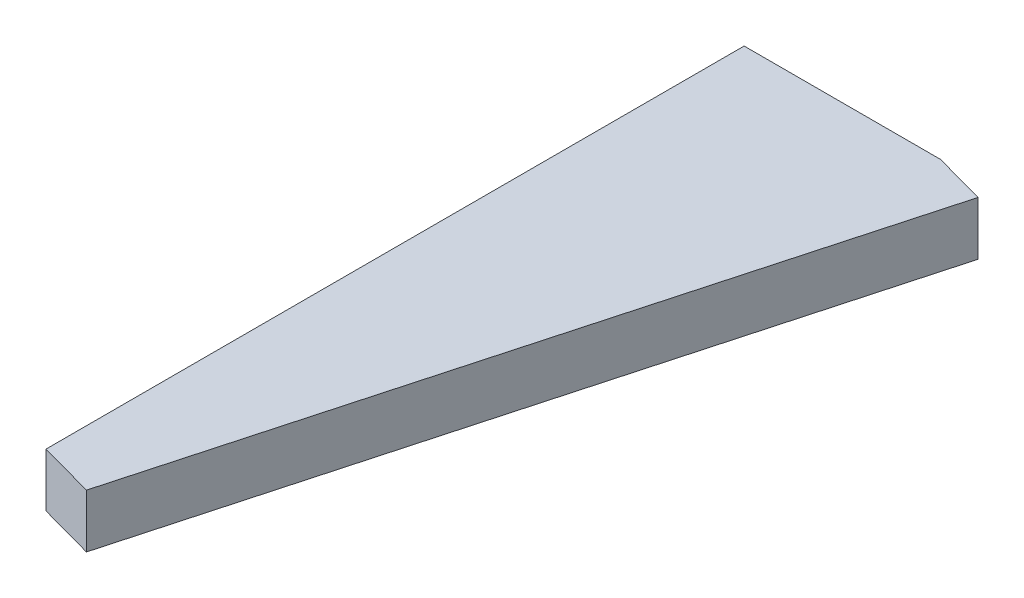
ISO-10303-21;
HEADER;
FILE_DESCRIPTION(('STEP AP214'),'2;1');
FILE_NAME('part.step','',(''),(''),'','','');
FILE_SCHEMA(('AUTOMOTIVE_DESIGN { 1 0 10303 214 1 1 1 1 }'));
ENDSEC;
DATA;
#1=APPLICATION_CONTEXT('core data for automotive mechanical design processes');
#2=APPLICATION_PROTOCOL_DEFINITION('international standard','automotive_design',2000,#1);
#3=PRODUCT_CONTEXT('',#1,'mechanical');
#4=PRODUCT('Part','Part','',(#3));
#5=PRODUCT_RELATED_PRODUCT_CATEGORY('part','',(#4));
#6=PRODUCT_DEFINITION_FORMATION('','',#4);
#7=PRODUCT_DEFINITION_CONTEXT('part definition',#1,'design');
#8=PRODUCT_DEFINITION('design','',#6,#7);
#9=PRODUCT_DEFINITION_SHAPE('','',#8);
#10=(LENGTH_UNIT() NAMED_UNIT(*) SI_UNIT(.MILLI.,.METRE.));
#11=(NAMED_UNIT(*) PLANE_ANGLE_UNIT() SI_UNIT($,.RADIAN.));
#12=(NAMED_UNIT(*) SI_UNIT($,.STERADIAN.) SOLID_ANGLE_UNIT());
#13=UNCERTAINTY_MEASURE_WITH_UNIT(LENGTH_MEASURE(1.E-05),#10,'distance_accuracy_value','');
#14=(GEOMETRIC_REPRESENTATION_CONTEXT(3) GLOBAL_UNCERTAINTY_ASSIGNED_CONTEXT((#13)) GLOBAL_UNIT_ASSIGNED_CONTEXT((#10,
#11,#12)) REPRESENTATION_CONTEXT('',''));
#15=CARTESIAN_POINT('',(0.,0.,0.));
#16=DIRECTION('',(0.,0.,1.));
#17=DIRECTION('',(1.,0.,0.));
#18=AXIS2_PLACEMENT_3D('',#15,#16,#17);
#19=CARTESIAN_POINT('',(13.8926161784114,3.,-39.2045305509369));
#20=DIRECTION('',(0.96420539280379,0.,0.265156483021042));
#21=DIRECTION('',(0.265156483021042,0.,-0.96420539280379));
#22=AXIS2_PLACEMENT_3D('',#19,#20,#21);
#23=PLANE('',#22);
#24=DIRECTION('',(-0.265156483021042,0.,0.96420539280379));
#25=VECTOR('',#24,1.);
#26=CARTESIAN_POINT('',(13.8926161784114,0.,-39.2045305509369));
#27=LINE('',#26,#25);
#28=CARTESIAN_POINT('',(13.8926161784114,0.,-39.2045305509369));
#29=VERTEX_POINT('',#28);
#30=CARTESIAN_POINT('',(3.12330231863968,0.,-0.0433892426761686));
#31=VERTEX_POINT('',#30);
#32=EDGE_CURVE('E111',#29,#31,#27,.T.);
#33=ORIENTED_EDGE('',*,*,#32,.F.);
#34=DIRECTION('',(0.,-1.,0.));
#35=VECTOR('',#34,1.);
#36=CARTESIAN_POINT('',(13.8926161784114,3.,-39.2045305509369));
#37=LINE('',#36,#35);
#38=CARTESIAN_POINT('',(13.8926161784114,3.,-39.2045305509369));
#39=VERTEX_POINT('',#38);
#40=EDGE_CURVE('E11',#39,#29,#37,.T.);
#41=ORIENTED_EDGE('',*,*,#40,.F.);
#42=DIRECTION('',(-0.265156483021042,0.,0.96420539280379));
#43=VECTOR('',#42,1.);
#44=CARTESIAN_POINT('',(13.8926161784114,3.,-39.2045305509369));
#45=LINE('',#44,#43);
#46=CARTESIAN_POINT('',(3.12330231863968,3.,-0.0433892426761686));
#47=VERTEX_POINT('',#46);
#48=EDGE_CURVE('E106',#39,#47,#45,.T.);
#49=ORIENTED_EDGE('',*,*,#48,.T.);
#50=DIRECTION('',(0.,-1.,0.));
#51=VECTOR('',#50,1.);
#52=CARTESIAN_POINT('',(3.12330231863968,3.,-0.0433892426761686));
#53=LINE('',#52,#51);
#54=EDGE_CURVE('E36',#47,#31,#53,.T.);
#55=ORIENTED_EDGE('',*,*,#54,.T.);
#56=EDGE_LOOP('',(#33,#41,#49,#55));
#57=FACE_BOUND('',#56,.T.);
#58=ADVANCED_FACE('F33',(#57),#23,.T.);
#59=CARTESIAN_POINT('',(13.8926161784114,3.,-39.2045305509369));
#60=DIRECTION('',(-0.265156483021042,0.,0.96420539280379));
#61=DIRECTION('',(0.96420539280379,0.,0.265156483021042));
#62=AXIS2_PLACEMENT_3D('',#59,#60,#61);
#63=PLANE('',#62);
#64=DIRECTION('',(-0.96420539280379,0.,-0.265156483021042));
#65=VECTOR('',#64,1.);
#66=CARTESIAN_POINT('',(13.8926161784114,0.,-39.2045305509369));
#67=LINE('',#66,#65);
#68=CARTESIAN_POINT('',(11.,0.,-40.));
#69=VERTEX_POINT('',#68);
#70=EDGE_CURVE('E120',#29,#69,#67,.T.);
#71=ORIENTED_EDGE('',*,*,#70,.T.);
#72=DIRECTION('',(0.,-1.,0.));
#73=VECTOR('',#72,1.);
#74=CARTESIAN_POINT('',(11.,3.,-40.));
#75=LINE('',#74,#73);
#76=CARTESIAN_POINT('',(11.,3.,-40.));
#77=VERTEX_POINT('',#76);
#78=EDGE_CURVE('E42',#77,#69,#75,.T.);
#79=ORIENTED_EDGE('',*,*,#78,.F.);
#80=DIRECTION('',(-0.96420539280379,0.,-0.265156483021042));
#81=VECTOR('',#80,1.);
#82=CARTESIAN_POINT('',(13.8926161784114,3.,-39.2045305509369));
#83=LINE('',#82,#81);
#84=EDGE_CURVE('E101',#39,#77,#83,.T.);
#85=ORIENTED_EDGE('',*,*,#84,.F.);
#86=ORIENTED_EDGE('',*,*,#40,.T.);
#87=EDGE_LOOP('',(#71,#79,#85,#86));
#88=FACE_BOUND('',#87,.T.);
#89=ADVANCED_FACE('F125',(#88),#63,.F.);
#90=CARTESIAN_POINT('',(0.,3.,-40.));
#91=DIRECTION('',(0.,0.,-1.));
#92=DIRECTION('',(-1.,0.,0.));
#93=AXIS2_PLACEMENT_3D('',#90,#91,#92);
#94=PLANE('',#93);
#95=DIRECTION('',(1.,0.,0.));
#96=VECTOR('',#95,1.);
#97=CARTESIAN_POINT('',(0.,0.,-40.));
#98=LINE('',#97,#96);
#99=CARTESIAN_POINT('',(0.,0.,-40.));
#100=VERTEX_POINT('',#99);
#101=EDGE_CURVE('E89',#100,#69,#98,.T.);
#102=ORIENTED_EDGE('',*,*,#101,.F.);
#103=DIRECTION('',(0.,-1.,0.));
#104=VECTOR('',#103,1.);
#105=CARTESIAN_POINT('',(0.,3.,-40.));
#106=LINE('',#105,#104);
#107=CARTESIAN_POINT('',(0.,3.,-40.));
#108=VERTEX_POINT('',#107);
#109=EDGE_CURVE('E84',#108,#100,#106,.T.);
#110=ORIENTED_EDGE('',*,*,#109,.F.);
#111=DIRECTION('',(1.,0.,0.));
#112=VECTOR('',#111,1.);
#113=CARTESIAN_POINT('',(0.,3.,-40.));
#114=LINE('',#113,#112);
#115=EDGE_CURVE('E87',#108,#77,#114,.T.);
#116=ORIENTED_EDGE('',*,*,#115,.T.);
#117=ORIENTED_EDGE('',*,*,#78,.T.);
#118=EDGE_LOOP('',(#102,#110,#116,#117));
#119=FACE_BOUND('',#118,.T.);
#120=ADVANCED_FACE('F86',(#119),#94,.T.);
#121=CARTESIAN_POINT('',(0.,3.,-0.902297380302093));
#122=DIRECTION('',(-1.,0.,0.));
#123=DIRECTION('',(0.,0.,1.));
#124=AXIS2_PLACEMENT_3D('',#121,#122,#123);
#125=PLANE('',#124);
#126=DIRECTION('',(0.,0.,-1.));
#127=VECTOR('',#126,1.);
#128=CARTESIAN_POINT('',(0.,0.,-0.902297380302093));
#129=LINE('',#128,#127);
#130=CARTESIAN_POINT('',(0.,0.,-0.902297380302093));
#131=VERTEX_POINT('',#130);
#132=EDGE_CURVE('E117',#131,#100,#129,.T.);
#133=ORIENTED_EDGE('',*,*,#132,.F.);
#134=DIRECTION('',(0.,-1.,0.));
#135=VECTOR('',#134,1.);
#136=CARTESIAN_POINT('',(0.,3.,-0.902297380302093));
#137=LINE('',#136,#135);
#138=CARTESIAN_POINT('',(0.,3.,-0.902297380302093));
#139=VERTEX_POINT('',#138);
#140=EDGE_CURVE('E94',#139,#131,#137,.T.);
#141=ORIENTED_EDGE('',*,*,#140,.F.);
#142=DIRECTION('',(0.,0.,-1.));
#143=VECTOR('',#142,1.);
#144=CARTESIAN_POINT('',(0.,3.,-0.902297380302093));
#145=LINE('',#144,#143);
#146=EDGE_CURVE('E100',#139,#108,#145,.T.);
#147=ORIENTED_EDGE('',*,*,#146,.T.);
#148=ORIENTED_EDGE('',*,*,#109,.T.);
#149=EDGE_LOOP('',(#133,#141,#147,#148));
#150=FACE_BOUND('',#149,.T.);
#151=ADVANCED_FACE('F103',(#150),#125,.T.);
#152=CARTESIAN_POINT('',(3.12330231863968,3.,-0.0433892426761686));
#153=DIRECTION('',(-0.265156483021046,0.,0.964205392803789));
#154=DIRECTION('',(0.96420539280379,0.,0.265156483021046));
#155=AXIS2_PLACEMENT_3D('',#152,#153,#154);
#156=PLANE('',#155);
#157=DIRECTION('',(-0.964205392803789,0.,-0.265156483021046));
#158=VECTOR('',#157,1.);
#159=CARTESIAN_POINT('',(3.12330231863968,0.,-0.0433892426761686));
#160=LINE('',#159,#158);
#161=EDGE_CURVE('E114',#31,#131,#160,.T.);
#162=ORIENTED_EDGE('',*,*,#161,.F.);
#163=ORIENTED_EDGE('',*,*,#54,.F.);
#164=DIRECTION('',(-0.964205392803789,0.,-0.265156483021046));
#165=VECTOR('',#164,1.);
#166=CARTESIAN_POINT('',(3.12330231863968,3.,-0.0433892426761686));
#167=LINE('',#166,#165);
#168=EDGE_CURVE('E104',#47,#139,#167,.T.);
#169=ORIENTED_EDGE('',*,*,#168,.T.);
#170=ORIENTED_EDGE('',*,*,#140,.T.);
#171=EDGE_LOOP('',(#162,#163,#169,#170));
#172=FACE_BOUND('',#171,.T.);
#173=ADVANCED_FACE('F122',(#172),#156,.T.);
#174=CARTESIAN_POINT('',(0.,3.,0.));
#175=DIRECTION('',(0.,-1.,0.));
#176=DIRECTION('',(0.,0.,-1.));
#177=AXIS2_PLACEMENT_3D('',#174,#175,#176);
#178=PLANE('',#177);
#179=ORIENTED_EDGE('',*,*,#48,.F.);
#180=ORIENTED_EDGE('',*,*,#84,.T.);
#181=ORIENTED_EDGE('',*,*,#115,.F.);
#182=ORIENTED_EDGE('',*,*,#146,.F.);
#183=ORIENTED_EDGE('',*,*,#168,.F.);
#184=EDGE_LOOP('',(#179,#180,#181,#182,#183));
#185=FACE_BOUND('',#184,.T.);
#186=ADVANCED_FACE('F99',(#185),#178,.F.);
#187=CARTESIAN_POINT('',(0.,0.,0.));
#188=DIRECTION('',(0.,-1.,0.));
#189=DIRECTION('',(0.,0.,-1.));
#190=AXIS2_PLACEMENT_3D('',#187,#188,#189);
#191=PLANE('',#190);
#192=ORIENTED_EDGE('',*,*,#32,.T.);
#193=ORIENTED_EDGE('',*,*,#161,.T.);
#194=ORIENTED_EDGE('',*,*,#132,.T.);
#195=ORIENTED_EDGE('',*,*,#101,.T.);
#196=ORIENTED_EDGE('',*,*,#70,.F.);
#197=EDGE_LOOP('',(#192,#193,#194,#195,#196));
#198=FACE_BOUND('',#197,.T.);
#199=ADVANCED_FACE('F124',(#198),#191,.T.);
#200=CLOSED_SHELL('',(#58,#89,#120,#151,#173,#186,#199));
#201=MANIFOLD_SOLID_BREP('B2',#200);
#202=ADVANCED_BREP_SHAPE_REPRESENTATION('',(#18,#201),#14);
#203=SHAPE_DEFINITION_REPRESENTATION(#9,#202);
ENDSEC;
END-ISO-10303-21;
